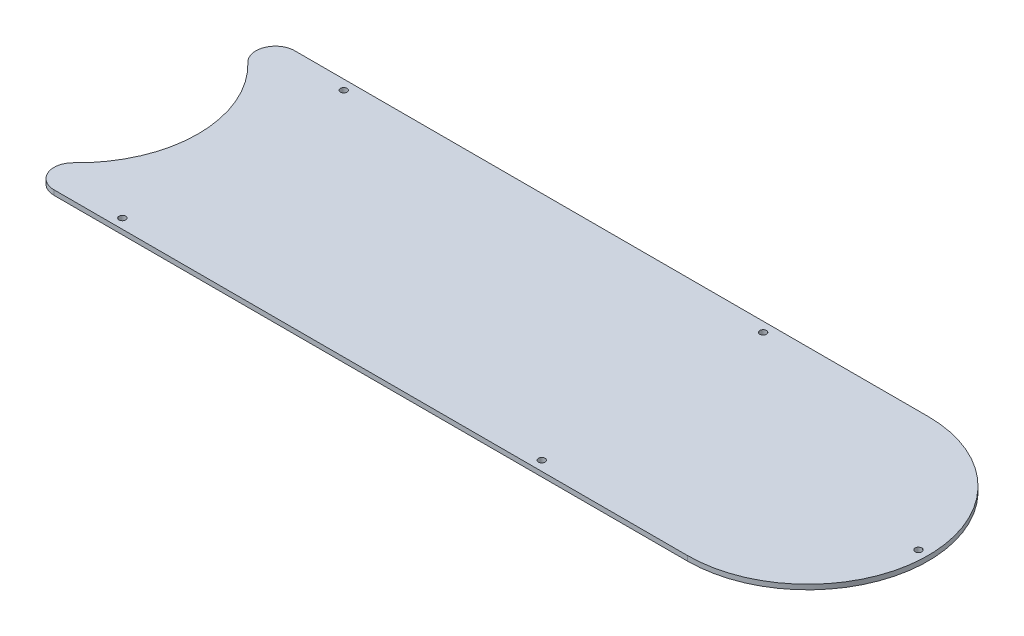
ISO-10303-21;
HEADER;
FILE_DESCRIPTION(('STEP AP214'),'2;1');
FILE_NAME('part.step','',(''),(''),'','','');
FILE_SCHEMA(('AUTOMOTIVE_DESIGN { 1 0 10303 214 1 1 1 1 }'));
ENDSEC;
DATA;
#1=APPLICATION_CONTEXT('core data for automotive mechanical design processes');
#2=APPLICATION_PROTOCOL_DEFINITION('international standard','automotive_design',2000,#1);
#3=PRODUCT_CONTEXT('',#1,'mechanical');
#4=PRODUCT('Part','Part','',(#3));
#5=PRODUCT_RELATED_PRODUCT_CATEGORY('part','',(#4));
#6=PRODUCT_DEFINITION_FORMATION('','',#4);
#7=PRODUCT_DEFINITION_CONTEXT('part definition',#1,'design');
#8=PRODUCT_DEFINITION('design','',#6,#7);
#9=PRODUCT_DEFINITION_SHAPE('','',#8);
#10=(LENGTH_UNIT() NAMED_UNIT(*) SI_UNIT(.MILLI.,.METRE.));
#11=(NAMED_UNIT(*) PLANE_ANGLE_UNIT() SI_UNIT($,.RADIAN.));
#12=(NAMED_UNIT(*) SI_UNIT($,.STERADIAN.) SOLID_ANGLE_UNIT());
#13=UNCERTAINTY_MEASURE_WITH_UNIT(LENGTH_MEASURE(1.E-05),#10,'distance_accuracy_value','');
#14=(GEOMETRIC_REPRESENTATION_CONTEXT(3) GLOBAL_UNCERTAINTY_ASSIGNED_CONTEXT((#13)) GLOBAL_UNIT_ASSIGNED_CONTEXT((#10,
#11,#12)) REPRESENTATION_CONTEXT('',''));
#15=CARTESIAN_POINT('',(0.,0.,0.));
#16=DIRECTION('',(0.,0.,1.));
#17=DIRECTION('',(1.,0.,0.));
#18=AXIS2_PLACEMENT_3D('',#15,#16,#17);
#19=CARTESIAN_POINT('',(238.76,1.5875,0.));
#20=DIRECTION('',(0.,1.,0.));
#21=DIRECTION('',(0.,0.,1.));
#22=AXIS2_PLACEMENT_3D('',#19,#20,#21);
#23=PLANE('',#22);
#24=CARTESIAN_POINT('',(50.8,1.5875,36.195));
#25=DIRECTION('',(0.,1.,0.));
#26=DIRECTION('',(0.,0.,-1.));
#27=AXIS2_PLACEMENT_3D('',#24,#25,#26);
#28=CIRCLE('',#27,1.0922);
#29=CARTESIAN_POINT('',(50.8,1.5875,35.1028));
#30=VERTEX_POINT('',#29);
#31=EDGE_CURVE('E164',#30,#30,#28,.T.);
#32=ORIENTED_EDGE('',*,*,#31,.F.);
#33=EDGE_LOOP('',(#32));
#34=FACE_BOUND('',#33,.T.);
#35=CARTESIAN_POINT('',(187.96,1.5875,-36.195));
#36=DIRECTION('',(0.,1.,0.));
#37=DIRECTION('',(0.,0.,1.));
#38=AXIS2_PLACEMENT_3D('',#35,#36,#37);
#39=CIRCLE('',#38,1.09219999999998);
#40=CARTESIAN_POINT('',(187.96,1.5875,-35.1028));
#41=VERTEX_POINT('',#40);
#42=EDGE_CURVE('E152',#41,#41,#39,.T.);
#43=ORIENTED_EDGE('',*,*,#42,.F.);
#44=EDGE_LOOP('',(#43));
#45=FACE_BOUND('',#44,.T.);
#46=CARTESIAN_POINT('',(0.,1.5875,0.));
#47=DIRECTION('',(0.,-1.,0.));
#48=DIRECTION('',(0.,0.,1.));
#49=AXIS2_PLACEMENT_3D('',#46,#47,#48);
#50=CIRCLE('',#49,39.37);
#51=CARTESIAN_POINT('',(27.2306970651565,1.5875,-28.4338888888889));
#52=VERTEX_POINT('',#51);
#53=CARTESIAN_POINT('',(27.2306970651565,1.5875,28.4338888888889));
#54=VERTEX_POINT('',#53);
#55=EDGE_CURVE('E95',#52,#54,#50,.T.);
#56=ORIENTED_EDGE('',*,*,#55,.T.);
#57=CARTESIAN_POINT('',(31.6227449788914,1.5875,33.02));
#58=DIRECTION('',(0.,1.,0.));
#59=DIRECTION('',(0.,0.,1.));
#60=AXIS2_PLACEMENT_3D('',#57,#58,#59);
#61=CIRCLE('',#60,6.35);
#62=CARTESIAN_POINT('',(31.6227449788914,1.5875,39.37));
#63=VERTEX_POINT('',#62);
#64=EDGE_CURVE('E43',#54,#63,#61,.T.);
#65=ORIENTED_EDGE('',*,*,#64,.T.);
#66=DIRECTION('',(1.,0.,0.));
#67=VECTOR('',#66,1.);
#68=CARTESIAN_POINT('',(0.,1.5875,39.37));
#69=LINE('',#68,#67);
#70=CARTESIAN_POINT('',(238.76,1.5875,39.37));
#71=VERTEX_POINT('',#70);
#72=EDGE_CURVE('E101',#63,#71,#69,.T.);
#73=ORIENTED_EDGE('',*,*,#72,.T.);
#74=CARTESIAN_POINT('',(238.76,1.5875,0.));
#75=DIRECTION('',(0.,1.,0.));
#76=DIRECTION('',(0.,0.,1.));
#77=AXIS2_PLACEMENT_3D('',#74,#75,#76);
#78=CIRCLE('',#77,39.37);
#79=CARTESIAN_POINT('',(238.76,1.5875,-39.37));
#80=VERTEX_POINT('',#79);
#81=EDGE_CURVE('E96',#71,#80,#78,.T.);
#82=ORIENTED_EDGE('',*,*,#81,.T.);
#83=DIRECTION('',(-1.,0.,0.));
#84=VECTOR('',#83,1.);
#85=CARTESIAN_POINT('',(238.76,1.5875,-39.37));
#86=LINE('',#85,#84);
#87=CARTESIAN_POINT('',(31.6227449788914,1.5875,-39.37));
#88=VERTEX_POINT('',#87);
#89=EDGE_CURVE('E87',#80,#88,#86,.T.);
#90=ORIENTED_EDGE('',*,*,#89,.T.);
#91=CARTESIAN_POINT('',(31.6227449788914,1.5875,-33.02));
#92=DIRECTION('',(0.,1.,0.));
#93=DIRECTION('',(0.,0.,1.));
#94=AXIS2_PLACEMENT_3D('',#91,#92,#93);
#95=CIRCLE('',#94,6.35);
#96=EDGE_CURVE('E126',#88,#52,#95,.T.);
#97=ORIENTED_EDGE('',*,*,#96,.T.);
#98=EDGE_LOOP('',(#56,#65,#73,#82,#90,#97));
#99=FACE_BOUND('',#98,.T.);
#100=CARTESIAN_POINT('',(274.955,1.5875,0.));
#101=DIRECTION('',(0.,1.,0.));
#102=DIRECTION('',(0.,0.,1.));
#103=AXIS2_PLACEMENT_3D('',#100,#101,#102);
#104=CIRCLE('',#103,1.09220000000001);
#105=CARTESIAN_POINT('',(274.955,1.5875,1.09220000000001));
#106=VERTEX_POINT('',#105);
#107=EDGE_CURVE('E146',#106,#106,#104,.T.);
#108=ORIENTED_EDGE('',*,*,#107,.F.);
#109=EDGE_LOOP('',(#108));
#110=FACE_BOUND('',#109,.T.);
#111=CARTESIAN_POINT('',(50.8,1.5875,-36.195));
#112=DIRECTION('',(0.,1.,0.));
#113=DIRECTION('',(0.,0.,1.));
#114=AXIS2_PLACEMENT_3D('',#111,#112,#113);
#115=CIRCLE('',#114,1.0922);
#116=CARTESIAN_POINT('',(50.8,1.5875,-35.1028));
#117=VERTEX_POINT('',#116);
#118=EDGE_CURVE('E158',#117,#117,#115,.T.);
#119=ORIENTED_EDGE('',*,*,#118,.F.);
#120=EDGE_LOOP('',(#119));
#121=FACE_BOUND('',#120,.T.);
#122=CARTESIAN_POINT('',(187.96,1.5875,36.195));
#123=DIRECTION('',(0.,1.,0.));
#124=DIRECTION('',(0.,0.,-1.));
#125=AXIS2_PLACEMENT_3D('',#122,#123,#124);
#126=CIRCLE('',#125,1.09219999999998);
#127=CARTESIAN_POINT('',(187.96,1.5875,35.1028));
#128=VERTEX_POINT('',#127);
#129=EDGE_CURVE('E170',#128,#128,#126,.T.);
#130=ORIENTED_EDGE('',*,*,#129,.F.);
#131=EDGE_LOOP('',(#130));
#132=FACE_BOUND('',#131,.T.);
#133=ADVANCED_FACE('F35',(#34,#45,#99,#110,#121,#132),#23,.T.);
#134=CARTESIAN_POINT('',(238.76,0.,0.));
#135=DIRECTION('',(0.,1.,0.));
#136=DIRECTION('',(0.,0.,1.));
#137=AXIS2_PLACEMENT_3D('',#134,#135,#136);
#138=PLANE('',#137);
#139=CARTESIAN_POINT('',(50.8,0.,36.195));
#140=DIRECTION('',(0.,1.,0.));
#141=DIRECTION('',(0.,0.,-1.));
#142=AXIS2_PLACEMENT_3D('',#139,#140,#141);
#143=CIRCLE('',#142,1.0922);
#144=CARTESIAN_POINT('',(50.8,0.,35.1028));
#145=VERTEX_POINT('',#144);
#146=EDGE_CURVE('E167',#145,#145,#143,.T.);
#147=ORIENTED_EDGE('',*,*,#146,.T.);
#148=EDGE_LOOP('',(#147));
#149=FACE_BOUND('',#148,.T.);
#150=CARTESIAN_POINT('',(187.96,0.,-36.195));
#151=DIRECTION('',(0.,1.,0.));
#152=DIRECTION('',(0.,0.,1.));
#153=AXIS2_PLACEMENT_3D('',#150,#151,#152);
#154=CIRCLE('',#153,1.09219999999998);
#155=CARTESIAN_POINT('',(187.96,0.,-35.1028));
#156=VERTEX_POINT('',#155);
#157=EDGE_CURVE('E155',#156,#156,#154,.T.);
#158=ORIENTED_EDGE('',*,*,#157,.T.);
#159=EDGE_LOOP('',(#158));
#160=FACE_BOUND('',#159,.T.);
#161=DIRECTION('',(1.,0.,0.));
#162=VECTOR('',#161,1.);
#163=CARTESIAN_POINT('',(0.,0.,39.37));
#164=LINE('',#163,#162);
#165=CARTESIAN_POINT('',(31.6227449788914,0.,39.37));
#166=VERTEX_POINT('',#165);
#167=CARTESIAN_POINT('',(238.76,0.,39.37));
#168=VERTEX_POINT('',#167);
#169=EDGE_CURVE('E105',#166,#168,#164,.T.);
#170=ORIENTED_EDGE('',*,*,#169,.F.);
#171=CARTESIAN_POINT('',(31.6227449788914,0.,33.02));
#172=DIRECTION('',(0.,1.,0.));
#173=DIRECTION('',(0.,0.,1.));
#174=AXIS2_PLACEMENT_3D('',#171,#172,#173);
#175=CIRCLE('',#174,6.35);
#176=CARTESIAN_POINT('',(27.2306970651565,0.,28.4338888888889));
#177=VERTEX_POINT('',#176);
#178=EDGE_CURVE('E120',#166,#177,#175,.F.);
#179=ORIENTED_EDGE('',*,*,#178,.T.);
#180=CARTESIAN_POINT('',(0.,0.,0.));
#181=DIRECTION('',(0.,-1.,0.));
#182=DIRECTION('',(0.,0.,1.));
#183=AXIS2_PLACEMENT_3D('',#180,#181,#182);
#184=CIRCLE('',#183,39.37);
#185=CARTESIAN_POINT('',(27.2306970651565,0.,-28.4338888888889));
#186=VERTEX_POINT('',#185);
#187=EDGE_CURVE('E139',#186,#177,#184,.T.);
#188=ORIENTED_EDGE('',*,*,#187,.F.);
#189=CARTESIAN_POINT('',(31.6227449788914,0.,-33.02));
#190=DIRECTION('',(0.,1.,0.));
#191=DIRECTION('',(0.,0.,1.));
#192=AXIS2_PLACEMENT_3D('',#189,#190,#191);
#193=CIRCLE('',#192,6.35);
#194=CARTESIAN_POINT('',(31.6227449788914,0.,-39.37));
#195=VERTEX_POINT('',#194);
#196=EDGE_CURVE('E114',#186,#195,#193,.F.);
#197=ORIENTED_EDGE('',*,*,#196,.T.);
#198=DIRECTION('',(-1.,0.,0.));
#199=VECTOR('',#198,1.);
#200=CARTESIAN_POINT('',(238.76,0.,-39.37));
#201=LINE('',#200,#199);
#202=CARTESIAN_POINT('',(238.76,0.,-39.37));
#203=VERTEX_POINT('',#202);
#204=EDGE_CURVE('E142',#203,#195,#201,.T.);
#205=ORIENTED_EDGE('',*,*,#204,.F.);
#206=CARTESIAN_POINT('',(238.76,0.,0.));
#207=DIRECTION('',(0.,1.,0.));
#208=DIRECTION('',(0.,0.,1.));
#209=AXIS2_PLACEMENT_3D('',#206,#207,#208);
#210=CIRCLE('',#209,39.37);
#211=EDGE_CURVE('E109',#168,#203,#210,.T.);
#212=ORIENTED_EDGE('',*,*,#211,.F.);
#213=EDGE_LOOP('',(#170,#179,#188,#197,#205,#212));
#214=FACE_BOUND('',#213,.T.);
#215=CARTESIAN_POINT('',(274.955,0.,0.));
#216=DIRECTION('',(0.,1.,0.));
#217=DIRECTION('',(0.,0.,1.));
#218=AXIS2_PLACEMENT_3D('',#215,#216,#217);
#219=CIRCLE('',#218,1.09220000000001);
#220=CARTESIAN_POINT('',(274.955,0.,1.09220000000001));
#221=VERTEX_POINT('',#220);
#222=EDGE_CURVE('E149',#221,#221,#219,.T.);
#223=ORIENTED_EDGE('',*,*,#222,.T.);
#224=EDGE_LOOP('',(#223));
#225=FACE_BOUND('',#224,.T.);
#226=CARTESIAN_POINT('',(50.8,0.,-36.195));
#227=DIRECTION('',(0.,1.,0.));
#228=DIRECTION('',(0.,0.,1.));
#229=AXIS2_PLACEMENT_3D('',#226,#227,#228);
#230=CIRCLE('',#229,1.0922);
#231=CARTESIAN_POINT('',(50.8,0.,-35.1028));
#232=VERTEX_POINT('',#231);
#233=EDGE_CURVE('E161',#232,#232,#230,.T.);
#234=ORIENTED_EDGE('',*,*,#233,.T.);
#235=EDGE_LOOP('',(#234));
#236=FACE_BOUND('',#235,.T.);
#237=CARTESIAN_POINT('',(187.96,0.,36.195));
#238=DIRECTION('',(0.,1.,0.));
#239=DIRECTION('',(0.,0.,-1.));
#240=AXIS2_PLACEMENT_3D('',#237,#238,#239);
#241=CIRCLE('',#240,1.09219999999998);
#242=CARTESIAN_POINT('',(187.96,0.,35.1028));
#243=VERTEX_POINT('',#242);
#244=EDGE_CURVE('E173',#243,#243,#241,.T.);
#245=ORIENTED_EDGE('',*,*,#244,.T.);
#246=EDGE_LOOP('',(#245));
#247=FACE_BOUND('',#246,.T.);
#248=ADVANCED_FACE('F137',(#149,#160,#214,#225,#236,#247),#138,.F.);
#249=CARTESIAN_POINT('',(238.76,1.5875,0.));
#250=DIRECTION('',(0.,-1.,0.));
#251=DIRECTION('',(0.,0.,-1.));
#252=AXIS2_PLACEMENT_3D('',#249,#250,#251);
#253=CYLINDRICAL_SURFACE('',#252,39.37);
#254=ORIENTED_EDGE('',*,*,#211,.T.);
#255=DIRECTION('',(0.,-1.,0.));
#256=VECTOR('',#255,1.);
#257=CARTESIAN_POINT('',(238.76,1.5875,-39.37));
#258=LINE('',#257,#256);
#259=EDGE_CURVE('E91',#80,#203,#258,.T.);
#260=ORIENTED_EDGE('',*,*,#259,.F.);
#261=ORIENTED_EDGE('',*,*,#81,.F.);
#262=DIRECTION('',(0.,-1.,0.));
#263=VECTOR('',#262,1.);
#264=CARTESIAN_POINT('',(238.76,1.5875,39.37));
#265=LINE('',#264,#263);
#266=EDGE_CURVE('E111',#71,#168,#265,.T.);
#267=ORIENTED_EDGE('',*,*,#266,.T.);
#268=EDGE_LOOP('',(#254,#260,#261,#267));
#269=FACE_BOUND('',#268,.T.);
#270=ADVANCED_FACE('F107',(#269),#253,.T.);
#271=CARTESIAN_POINT('',(238.76,1.5875,-39.37));
#272=DIRECTION('',(0.,0.,1.));
#273=DIRECTION('',(1.,0.,0.));
#274=AXIS2_PLACEMENT_3D('',#271,#272,#273);
#275=PLANE('',#274);
#276=ORIENTED_EDGE('',*,*,#204,.T.);
#277=DIRECTION('',(0.,-1.,0.));
#278=VECTOR('',#277,1.);
#279=CARTESIAN_POINT('',(31.6227449788914,1.5875,-39.37));
#280=LINE('',#279,#278);
#281=EDGE_CURVE('E11',#195,#88,#280,.F.);
#282=ORIENTED_EDGE('',*,*,#281,.T.);
#283=ORIENTED_EDGE('',*,*,#89,.F.);
#284=ORIENTED_EDGE('',*,*,#259,.T.);
#285=EDGE_LOOP('',(#276,#282,#283,#284));
#286=FACE_BOUND('',#285,.T.);
#287=ADVANCED_FACE('F89',(#286),#275,.F.);
#288=CARTESIAN_POINT('',(0.,1.5875,0.));
#289=DIRECTION('',(0.,-1.,0.));
#290=DIRECTION('',(0.,0.,-1.));
#291=AXIS2_PLACEMENT_3D('',#288,#289,#290);
#292=CYLINDRICAL_SURFACE('',#291,39.37);
#293=ORIENTED_EDGE('',*,*,#187,.T.);
#294=DIRECTION('',(0.,-1.,0.));
#295=VECTOR('',#294,1.);
#296=CARTESIAN_POINT('',(27.2306970651565,1.5875,28.4338888888889));
#297=LINE('',#296,#295);
#298=EDGE_CURVE('E56',#177,#54,#297,.F.);
#299=ORIENTED_EDGE('',*,*,#298,.T.);
#300=ORIENTED_EDGE('',*,*,#55,.F.);
#301=DIRECTION('',(0.,-1.,0.));
#302=VECTOR('',#301,1.);
#303=CARTESIAN_POINT('',(27.2306970651565,1.5875,-28.4338888888889));
#304=LINE('',#303,#302);
#305=EDGE_CURVE('E122',#52,#186,#304,.T.);
#306=ORIENTED_EDGE('',*,*,#305,.T.);
#307=EDGE_LOOP('',(#293,#299,#300,#306));
#308=FACE_BOUND('',#307,.T.);
#309=ADVANCED_FACE('F140',(#308),#292,.F.);
#310=CARTESIAN_POINT('',(0.,1.5875,39.37));
#311=DIRECTION('',(0.,0.,-1.));
#312=DIRECTION('',(-1.,0.,0.));
#313=AXIS2_PLACEMENT_3D('',#310,#311,#312);
#314=PLANE('',#313);
#315=ORIENTED_EDGE('',*,*,#72,.F.);
#316=DIRECTION('',(0.,-1.,0.));
#317=VECTOR('',#316,1.);
#318=CARTESIAN_POINT('',(31.6227449788914,1.5875,39.37));
#319=LINE('',#318,#317);
#320=EDGE_CURVE('E110',#63,#166,#319,.T.);
#321=ORIENTED_EDGE('',*,*,#320,.T.);
#322=ORIENTED_EDGE('',*,*,#169,.T.);
#323=ORIENTED_EDGE('',*,*,#266,.F.);
#324=EDGE_LOOP('',(#315,#321,#322,#323));
#325=FACE_BOUND('',#324,.T.);
#326=ADVANCED_FACE('F131',(#325),#314,.F.);
#327=CARTESIAN_POINT('',(274.955,1.5875,0.));
#328=DIRECTION('',(0.,-1.,0.));
#329=DIRECTION('',(0.,0.,-1.));
#330=AXIS2_PLACEMENT_3D('',#327,#328,#329);
#331=CYLINDRICAL_SURFACE('',#330,1.09220000000001);
#332=ORIENTED_EDGE('',*,*,#107,.T.);
#333=EDGE_LOOP('',(#332));
#334=FACE_BOUND('',#333,.T.);
#335=ORIENTED_EDGE('',*,*,#222,.F.);
#336=EDGE_LOOP('',(#335));
#337=FACE_BOUND('',#336,.T.);
#338=ADVANCED_FACE('F193',(#334,#337),#331,.F.);
#339=CARTESIAN_POINT('',(187.96,1.5875,-36.195));
#340=DIRECTION('',(0.,-1.,0.));
#341=DIRECTION('',(0.,0.,-1.));
#342=AXIS2_PLACEMENT_3D('',#339,#340,#341);
#343=CYLINDRICAL_SURFACE('',#342,1.09219999999998);
#344=ORIENTED_EDGE('',*,*,#42,.T.);
#345=EDGE_LOOP('',(#344));
#346=FACE_BOUND('',#345,.T.);
#347=ORIENTED_EDGE('',*,*,#157,.F.);
#348=EDGE_LOOP('',(#347));
#349=FACE_BOUND('',#348,.T.);
#350=ADVANCED_FACE('F219',(#346,#349),#343,.F.);
#351=CARTESIAN_POINT('',(50.8,1.5875,-36.195));
#352=DIRECTION('',(0.,-1.,0.));
#353=DIRECTION('',(0.,0.,-1.));
#354=AXIS2_PLACEMENT_3D('',#351,#352,#353);
#355=CYLINDRICAL_SURFACE('',#354,1.0922);
#356=ORIENTED_EDGE('',*,*,#118,.T.);
#357=EDGE_LOOP('',(#356));
#358=FACE_BOUND('',#357,.T.);
#359=ORIENTED_EDGE('',*,*,#233,.F.);
#360=EDGE_LOOP('',(#359));
#361=FACE_BOUND('',#360,.T.);
#362=ADVANCED_FACE('F214',(#358,#361),#355,.F.);
#363=CARTESIAN_POINT('',(50.8,1.5875,36.195));
#364=DIRECTION('',(0.,-1.,0.));
#365=DIRECTION('',(0.,0.,-1.));
#366=AXIS2_PLACEMENT_3D('',#363,#364,#365);
#367=CYLINDRICAL_SURFACE('',#366,1.0922);
#368=ORIENTED_EDGE('',*,*,#31,.T.);
#369=EDGE_LOOP('',(#368));
#370=FACE_BOUND('',#369,.T.);
#371=ORIENTED_EDGE('',*,*,#146,.F.);
#372=EDGE_LOOP('',(#371));
#373=FACE_BOUND('',#372,.T.);
#374=ADVANCED_FACE('F209',(#370,#373),#367,.F.);
#375=CARTESIAN_POINT('',(187.96,1.5875,36.195));
#376=DIRECTION('',(0.,-1.,0.));
#377=DIRECTION('',(0.,0.,-1.));
#378=AXIS2_PLACEMENT_3D('',#375,#376,#377);
#379=CYLINDRICAL_SURFACE('',#378,1.09219999999998);
#380=ORIENTED_EDGE('',*,*,#129,.T.);
#381=EDGE_LOOP('',(#380));
#382=FACE_BOUND('',#381,.T.);
#383=ORIENTED_EDGE('',*,*,#244,.F.);
#384=EDGE_LOOP('',(#383));
#385=FACE_BOUND('',#384,.T.);
#386=ADVANCED_FACE('F179',(#382,#385),#379,.F.);
#387=CARTESIAN_POINT('',(31.6227449788914,1.5875,33.02));
#388=DIRECTION('',(0.,-1.,0.));
#389=DIRECTION('',(0.,0.,-1.));
#390=AXIS2_PLACEMENT_3D('',#387,#388,#389);
#391=CYLINDRICAL_SURFACE('',#390,6.35);
#392=ORIENTED_EDGE('',*,*,#64,.F.);
#393=ORIENTED_EDGE('',*,*,#298,.F.);
#394=ORIENTED_EDGE('',*,*,#178,.F.);
#395=ORIENTED_EDGE('',*,*,#320,.F.);
#396=EDGE_LOOP('',(#392,#393,#394,#395));
#397=FACE_BOUND('',#396,.T.);
#398=ADVANCED_FACE('F134',(#397),#391,.T.);
#399=CARTESIAN_POINT('',(31.6227449788914,1.5875,-33.02));
#400=DIRECTION('',(0.,-1.,0.));
#401=DIRECTION('',(0.,0.,-1.));
#402=AXIS2_PLACEMENT_3D('',#399,#400,#401);
#403=CYLINDRICAL_SURFACE('',#402,6.35);
#404=ORIENTED_EDGE('',*,*,#96,.F.);
#405=ORIENTED_EDGE('',*,*,#281,.F.);
#406=ORIENTED_EDGE('',*,*,#196,.F.);
#407=ORIENTED_EDGE('',*,*,#305,.F.);
#408=EDGE_LOOP('',(#404,#405,#406,#407));
#409=FACE_BOUND('',#408,.T.);
#410=ADVANCED_FACE('F37',(#409),#403,.T.);
#411=CLOSED_SHELL('',(#133,#248,#270,#287,#309,#326,#338,#350,#362,#374,#386,#398,#410));
#412=MANIFOLD_SOLID_BREP('B2',#411);
#413=ADVANCED_BREP_SHAPE_REPRESENTATION('',(#18,#412),#14);
#414=SHAPE_DEFINITION_REPRESENTATION(#9,#413);
ENDSEC;
END-ISO-10303-21;
